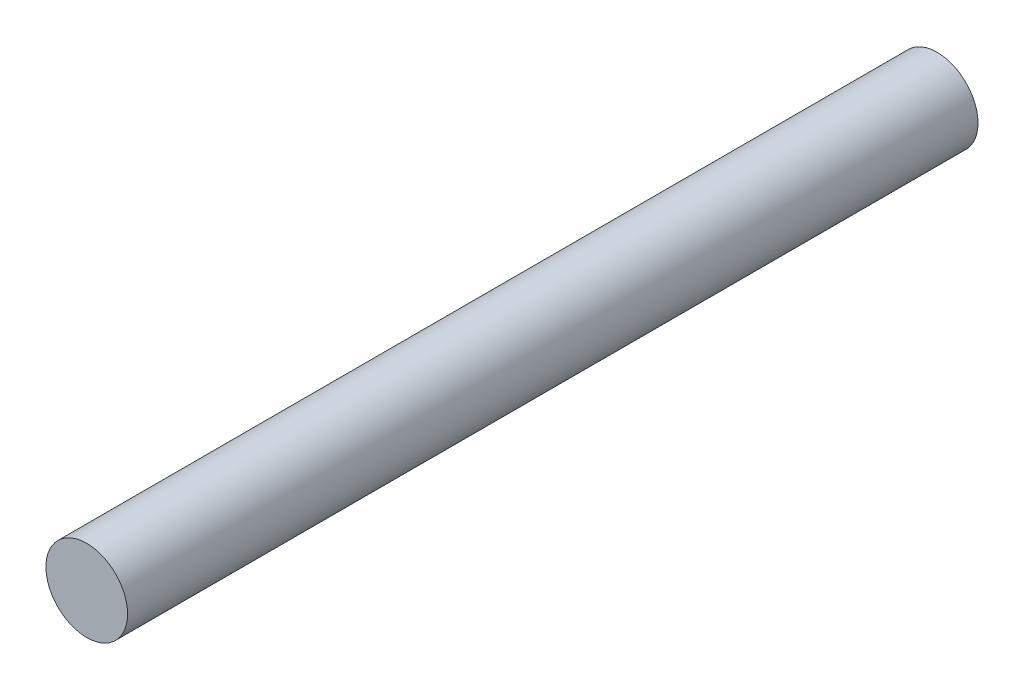
ISO-10303-21;
HEADER;
FILE_DESCRIPTION(('STEP AP214'),'2;1');
FILE_NAME('part.step','',(''),(''),'','','');
FILE_SCHEMA(('AUTOMOTIVE_DESIGN { 1 0 10303 214 1 1 1 1 }'));
ENDSEC;
DATA;
#1=APPLICATION_CONTEXT('core data for automotive mechanical design processes');
#2=APPLICATION_PROTOCOL_DEFINITION('international standard','automotive_design',2000,#1);
#3=PRODUCT_CONTEXT('',#1,'mechanical');
#4=PRODUCT('Part','Part','',(#3));
#5=PRODUCT_RELATED_PRODUCT_CATEGORY('part','',(#4));
#6=PRODUCT_DEFINITION_FORMATION('','',#4);
#7=PRODUCT_DEFINITION_CONTEXT('part definition',#1,'design');
#8=PRODUCT_DEFINITION('design','',#6,#7);
#9=PRODUCT_DEFINITION_SHAPE('','',#8);
#10=(LENGTH_UNIT() NAMED_UNIT(*) SI_UNIT(.MILLI.,.METRE.));
#11=(NAMED_UNIT(*) PLANE_ANGLE_UNIT() SI_UNIT($,.RADIAN.));
#12=(NAMED_UNIT(*) SI_UNIT($,.STERADIAN.) SOLID_ANGLE_UNIT());
#13=UNCERTAINTY_MEASURE_WITH_UNIT(LENGTH_MEASURE(1.E-05),#10,'distance_accuracy_value','');
#14=(GEOMETRIC_REPRESENTATION_CONTEXT(3) GLOBAL_UNCERTAINTY_ASSIGNED_CONTEXT((#13)) GLOBAL_UNIT_ASSIGNED_CONTEXT((#10,
#11,#12)) REPRESENTATION_CONTEXT('',''));
#15=CARTESIAN_POINT('',(0.,0.,0.));
#16=DIRECTION('',(0.,0.,1.));
#17=DIRECTION('',(1.,0.,0.));
#18=AXIS2_PLACEMENT_3D('',#15,#16,#17);
#19=CARTESIAN_POINT('',(0.,0.,125.));
#20=DIRECTION('',(0.,0.,-1.));
#21=DIRECTION('',(-1.,0.,0.));
#22=AXIS2_PLACEMENT_3D('',#19,#20,#21);
#23=CYLINDRICAL_SURFACE('',#22,6.);
#24=CARTESIAN_POINT('',(0.,0.,125.));
#25=DIRECTION('',(0.,0.,1.));
#26=DIRECTION('',(1.,0.,0.));
#27=AXIS2_PLACEMENT_3D('',#24,#25,#26);
#28=CIRCLE('',#27,6.);
#29=CARTESIAN_POINT('',(6.,0.,125.));
#30=VERTEX_POINT('',#29);
#31=EDGE_CURVE('E10',#30,#30,#28,.T.);
#32=ORIENTED_EDGE('',*,*,#31,.F.);
#33=EDGE_LOOP('',(#32));
#34=FACE_BOUND('',#33,.T.);
#35=CARTESIAN_POINT('',(0.,0.,0.));
#36=DIRECTION('',(0.,0.,1.));
#37=DIRECTION('',(1.,0.,0.));
#38=AXIS2_PLACEMENT_3D('',#35,#36,#37);
#39=CIRCLE('',#38,6.);
#40=CARTESIAN_POINT('',(6.,0.,0.));
#41=VERTEX_POINT('',#40);
#42=EDGE_CURVE('E46',#41,#41,#39,.T.);
#43=ORIENTED_EDGE('',*,*,#42,.T.);
#44=EDGE_LOOP('',(#43));
#45=FACE_BOUND('',#44,.T.);
#46=ADVANCED_FACE('F43',(#34,#45),#23,.T.);
#47=CARTESIAN_POINT('',(0.,0.,125.));
#48=DIRECTION('',(0.,0.,1.));
#49=DIRECTION('',(1.,0.,0.));
#50=AXIS2_PLACEMENT_3D('',#47,#48,#49);
#51=PLANE('',#50);
#52=ORIENTED_EDGE('',*,*,#31,.T.);
#53=EDGE_LOOP('',(#52));
#54=FACE_BOUND('',#53,.T.);
#55=ADVANCED_FACE('F60',(#54),#51,.T.);
#56=CARTESIAN_POINT('',(0.,0.,0.));
#57=DIRECTION('',(0.,0.,1.));
#58=DIRECTION('',(1.,0.,0.));
#59=AXIS2_PLACEMENT_3D('',#56,#57,#58);
#60=PLANE('',#59);
#61=ORIENTED_EDGE('',*,*,#42,.F.);
#62=EDGE_LOOP('',(#61));
#63=FACE_BOUND('',#62,.T.);
#64=ADVANCED_FACE('F58',(#63),#60,.F.);
#65=CLOSED_SHELL('',(#46,#55,#64));
#66=MANIFOLD_SOLID_BREP('B2',#65);
#67=ADVANCED_BREP_SHAPE_REPRESENTATION('',(#18,#66),#14);
#68=SHAPE_DEFINITION_REPRESENTATION(#9,#67);
ENDSEC;
END-ISO-10303-21;
